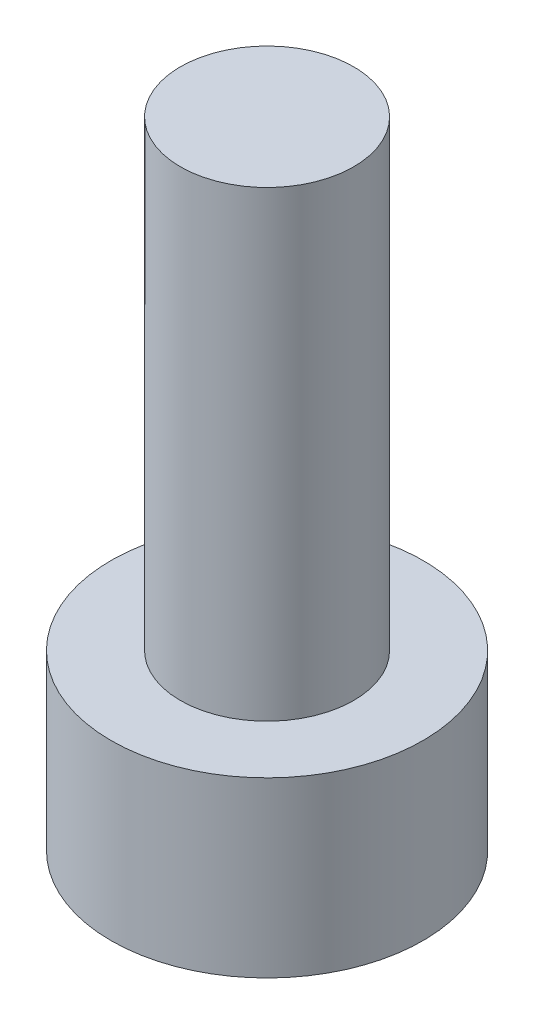
ISO-10303-21;
HEADER;
FILE_DESCRIPTION(('STEP AP214'),'2;1');
FILE_NAME('part.step','',(''),(''),'','','');
FILE_SCHEMA(('AUTOMOTIVE_DESIGN { 1 0 10303 214 1 1 1 1 }'));
ENDSEC;
DATA;
#1=APPLICATION_CONTEXT('core data for automotive mechanical design processes');
#2=APPLICATION_PROTOCOL_DEFINITION('international standard','automotive_design',2000,#1);
#3=PRODUCT_CONTEXT('',#1,'mechanical');
#4=PRODUCT('Part','Part','',(#3));
#5=PRODUCT_RELATED_PRODUCT_CATEGORY('part','',(#4));
#6=PRODUCT_DEFINITION_FORMATION('','',#4);
#7=PRODUCT_DEFINITION_CONTEXT('part definition',#1,'design');
#8=PRODUCT_DEFINITION('design','',#6,#7);
#9=PRODUCT_DEFINITION_SHAPE('','',#8);
#10=(LENGTH_UNIT() NAMED_UNIT(*) SI_UNIT(.MILLI.,.METRE.));
#11=(NAMED_UNIT(*) PLANE_ANGLE_UNIT() SI_UNIT($,.RADIAN.));
#12=(NAMED_UNIT(*) SI_UNIT($,.STERADIAN.) SOLID_ANGLE_UNIT());
#13=UNCERTAINTY_MEASURE_WITH_UNIT(LENGTH_MEASURE(1.E-05),#10,'distance_accuracy_value','');
#14=(GEOMETRIC_REPRESENTATION_CONTEXT(3) GLOBAL_UNCERTAINTY_ASSIGNED_CONTEXT((#13)) GLOBAL_UNIT_ASSIGNED_CONTEXT((#10,
#11,#12)) REPRESENTATION_CONTEXT('',''));
#15=CARTESIAN_POINT('',(0.,0.,0.));
#16=DIRECTION('',(0.,0.,1.));
#17=DIRECTION('',(1.,0.,0.));
#18=AXIS2_PLACEMENT_3D('',#15,#16,#17);
#19=CARTESIAN_POINT('',(0.,3.,0.));
#20=DIRECTION('',(0.,-1.,0.));
#21=DIRECTION('',(0.,0.,-1.));
#22=AXIS2_PLACEMENT_3D('',#19,#20,#21);
#23=CYLINDRICAL_SURFACE('',#22,2.7);
#24=CARTESIAN_POINT('',(0.,3.,0.));
#25=DIRECTION('',(0.,1.,0.));
#26=DIRECTION('',(0.,0.,1.));
#27=AXIS2_PLACEMENT_3D('',#24,#25,#26);
#28=CIRCLE('',#27,2.7);
#29=CARTESIAN_POINT('',(0.,3.,2.7));
#30=VERTEX_POINT('',#29);
#31=EDGE_CURVE('E39',#30,#30,#28,.T.);
#32=ORIENTED_EDGE('',*,*,#31,.F.);
#33=EDGE_LOOP('',(#32));
#34=FACE_BOUND('',#33,.T.);
#35=CARTESIAN_POINT('',(0.,0.,0.));
#36=DIRECTION('',(0.,1.,0.));
#37=DIRECTION('',(0.,0.,1.));
#38=AXIS2_PLACEMENT_3D('',#35,#36,#37);
#39=CIRCLE('',#38,2.7);
#40=CARTESIAN_POINT('',(0.,0.,2.7));
#41=VERTEX_POINT('',#40);
#42=EDGE_CURVE('E35',#41,#41,#39,.T.);
#43=ORIENTED_EDGE('',*,*,#42,.T.);
#44=EDGE_LOOP('',(#43));
#45=FACE_BOUND('',#44,.T.);
#46=ADVANCED_FACE('F32',(#34,#45),#23,.T.);
#47=CARTESIAN_POINT('',(0.,3.,0.));
#48=DIRECTION('',(0.,1.,0.));
#49=DIRECTION('',(0.,0.,1.));
#50=AXIS2_PLACEMENT_3D('',#47,#48,#49);
#51=PLANE('',#50);
#52=CARTESIAN_POINT('',(0.,3.,0.));
#53=DIRECTION('',(0.,1.,0.));
#54=DIRECTION('',(0.,0.,1.));
#55=AXIS2_PLACEMENT_3D('',#52,#53,#54);
#56=CIRCLE('',#55,1.5);
#57=CARTESIAN_POINT('',(0.,3.,1.5));
#58=VERTEX_POINT('',#57);
#59=EDGE_CURVE('E10',#58,#58,#56,.T.);
#60=ORIENTED_EDGE('',*,*,#59,.F.);
#61=EDGE_LOOP('',(#60));
#62=FACE_BOUND('',#61,.T.);
#63=ORIENTED_EDGE('',*,*,#31,.T.);
#64=EDGE_LOOP('',(#63));
#65=FACE_BOUND('',#64,.T.);
#66=ADVANCED_FACE('F56',(#62,#65),#51,.T.);
#67=CARTESIAN_POINT('',(0.,0.,0.));
#68=DIRECTION('',(0.,1.,0.));
#69=DIRECTION('',(0.,0.,1.));
#70=AXIS2_PLACEMENT_3D('',#67,#68,#69);
#71=PLANE('',#70);
#72=ORIENTED_EDGE('',*,*,#42,.F.);
#73=EDGE_LOOP('',(#72));
#74=FACE_BOUND('',#73,.T.);
#75=ADVANCED_FACE('F53',(#74),#71,.F.);
#76=CARTESIAN_POINT('',(0.,11.,0.));
#77=DIRECTION('',(0.,-1.,0.));
#78=DIRECTION('',(0.,0.,-1.));
#79=AXIS2_PLACEMENT_3D('',#76,#77,#78);
#80=CYLINDRICAL_SURFACE('',#79,1.5);
#81=CARTESIAN_POINT('',(0.,11.,0.));
#82=DIRECTION('',(0.,1.,0.));
#83=DIRECTION('',(0.,0.,1.));
#84=AXIS2_PLACEMENT_3D('',#81,#82,#83);
#85=CIRCLE('',#84,1.5);
#86=CARTESIAN_POINT('',(0.,11.,1.5));
#87=VERTEX_POINT('',#86);
#88=EDGE_CURVE('E45',#87,#87,#85,.T.);
#89=ORIENTED_EDGE('',*,*,#88,.F.);
#90=EDGE_LOOP('',(#89));
#91=FACE_BOUND('',#90,.T.);
#92=ORIENTED_EDGE('',*,*,#59,.T.);
#93=EDGE_LOOP('',(#92));
#94=FACE_BOUND('',#93,.T.);
#95=ADVANCED_FACE('F55',(#91,#94),#80,.T.);
#96=CARTESIAN_POINT('',(0.,11.,0.));
#97=DIRECTION('',(0.,1.,0.));
#98=DIRECTION('',(0.,0.,1.));
#99=AXIS2_PLACEMENT_3D('',#96,#97,#98);
#100=PLANE('',#99);
#101=ORIENTED_EDGE('',*,*,#88,.T.);
#102=EDGE_LOOP('',(#101));
#103=FACE_BOUND('',#102,.T.);
#104=ADVANCED_FACE('F61',(#103),#100,.T.);
#105=CLOSED_SHELL('',(#46,#66,#75,#95,#104));
#106=MANIFOLD_SOLID_BREP('B2',#105);
#107=ADVANCED_BREP_SHAPE_REPRESENTATION('',(#18,#106),#14);
#108=SHAPE_DEFINITION_REPRESENTATION(#9,#107);
ENDSEC;
END-ISO-10303-21;
